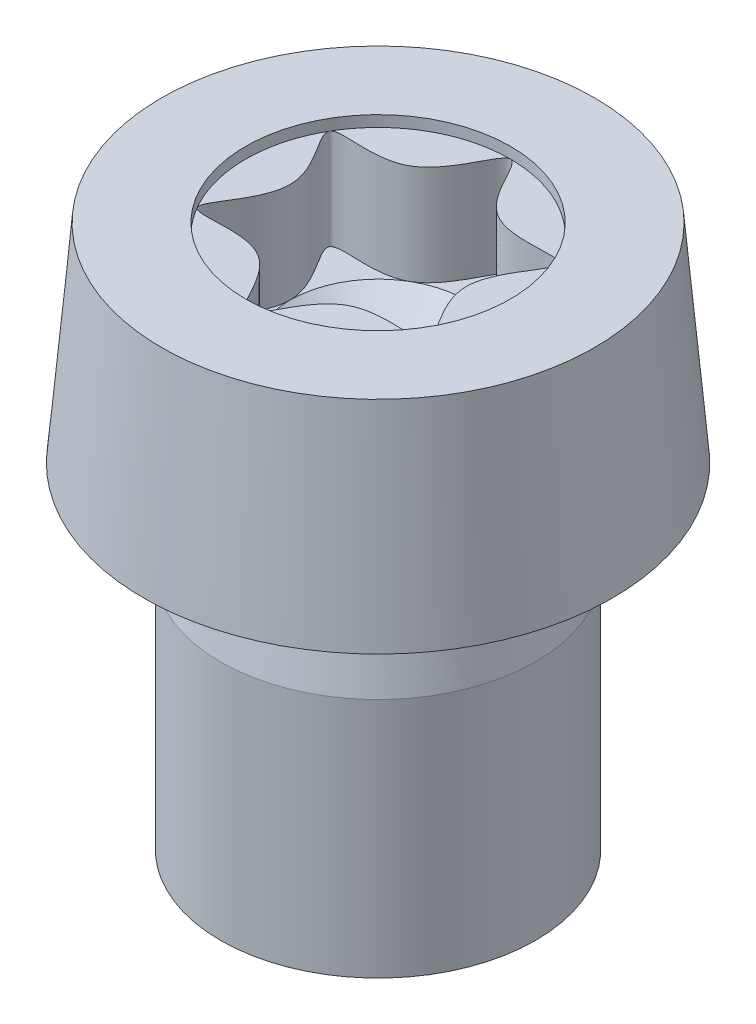
ISO-10303-21;
HEADER;
FILE_DESCRIPTION(('STEP AP214'),'2;1');
FILE_NAME('part.step','',(''),(''),'','','');
FILE_SCHEMA(('AUTOMOTIVE_DESIGN { 1 0 10303 214 1 1 1 1 }'));
ENDSEC;
DATA;
#1=APPLICATION_CONTEXT('core data for automotive mechanical design processes');
#2=APPLICATION_PROTOCOL_DEFINITION('international standard','automotive_design',2000,#1);
#3=PRODUCT_CONTEXT('',#1,'mechanical');
#4=PRODUCT('Part','Part','',(#3));
#5=PRODUCT_RELATED_PRODUCT_CATEGORY('part','',(#4));
#6=PRODUCT_DEFINITION_FORMATION('','',#4);
#7=PRODUCT_DEFINITION_CONTEXT('part definition',#1,'design');
#8=PRODUCT_DEFINITION('design','',#6,#7);
#9=PRODUCT_DEFINITION_SHAPE('','',#8);
#10=(LENGTH_UNIT() NAMED_UNIT(*) SI_UNIT(.MILLI.,.METRE.));
#11=(NAMED_UNIT(*) PLANE_ANGLE_UNIT() SI_UNIT($,.RADIAN.));
#12=(NAMED_UNIT(*) SI_UNIT($,.STERADIAN.) SOLID_ANGLE_UNIT());
#13=UNCERTAINTY_MEASURE_WITH_UNIT(LENGTH_MEASURE(1.E-05),#10,'distance_accuracy_value','');
#14=(GEOMETRIC_REPRESENTATION_CONTEXT(3) GLOBAL_UNCERTAINTY_ASSIGNED_CONTEXT((#13)) GLOBAL_UNIT_ASSIGNED_CONTEXT((#10,
#11,#12)) REPRESENTATION_CONTEXT('',''));
#15=CARTESIAN_POINT('',(0.,0.,0.));
#16=DIRECTION('',(0.,0.,1.));
#17=DIRECTION('',(1.,0.,0.));
#18=AXIS2_PLACEMENT_3D('',#15,#16,#17);
#19=CARTESIAN_POINT('',(0.,6.44,1.975));
#20=DIRECTION('',(0.,1.,0.));
#21=DIRECTION('',(0.,0.,1.));
#22=AXIS2_PLACEMENT_3D('',#19,#20,#21);
#23=PLANE('',#22);
#24=CARTESIAN_POINT('',(0.,6.44,-1.975));
#25=CARTESIAN_POINT('',(0.141989717055241,6.44,-1.975));
#26=CARTESIAN_POINT('',(0.425969151165719,6.44,-0.737800212276023));
#27=CARTESIAN_POINT('',(2.24612339533711,6.44,-1.296799946931));
#28=CARTESIAN_POINT('',(0.851938302331447,6.44,0.));
#29=CARTESIAN_POINT('',(2.24612339533711,6.44,1.29679994693099));
#30=CARTESIAN_POINT('',(0.425969151165727,6.44,0.737800212276034));
#31=CARTESIAN_POINT('',(0.,6.44,2.59359989386198));
#32=CARTESIAN_POINT('',(-0.425969151165738,6.44,0.737800212276044));
#33=CARTESIAN_POINT('',(-2.2461233953371,6.44,1.29679994693099));
#34=CARTESIAN_POINT('',(-0.851938302331447,6.44,0.));
#35=CARTESIAN_POINT('',(-2.2461233953371,6.44,-1.29679994693099));
#36=CARTESIAN_POINT('',(-0.425969151165735,6.44,-0.73780021227603));
#37=CARTESIAN_POINT('',(-0.141989717055244,6.44,-1.975));
#38=CARTESIAN_POINT('',(0.,6.44,-1.975));
#39=B_SPLINE_CURVE_WITH_KNOTS('',3,(#24,#25,#26,#27,#28,#29,#30,#31,#32,#33,#34,#35,#36,#37,
#38),.UNSPECIFIED.,.T.,.F.,(4,1,1,1,1,1,1,1,1,1,1,1,4),(0.,0.0833333333333328,0.166666666666667,
0.25,0.333333333333334,0.416666666666667,0.5,0.583333333333333,0.666666666666667,0.75,
0.833333333333333,0.916666666666666,1.),.UNSPECIFIED.);
#40=CARTESIAN_POINT('',(0.65833333333333,6.44,-1.14026678164951));
#41=VERTEX_POINT('',#40);
#42=CARTESIAN_POINT('',(1.31666666666667,6.44,0.));
#43=VERTEX_POINT('',#42);
#44=EDGE_CURVE('E141',#41,#43,#39,.T.);
#45=ORIENTED_EDGE('',*,*,#44,.F.);
#46=CARTESIAN_POINT('',(0.,6.44,0.));
#47=DIRECTION('',(0.,-1.,0.));
#48=DIRECTION('',(0.,0.,-1.));
#49=AXIS2_PLACEMENT_3D('',#46,#47,#48);
#50=CIRCLE('',#49,1.31666666666667);
#51=EDGE_CURVE('E52',#41,#43,#50,.T.);
#52=ORIENTED_EDGE('',*,*,#51,.T.);
#53=EDGE_LOOP('',(#45,#52));
#54=FACE_BOUND('',#53,.T.);
#55=ADVANCED_FACE('F39',(#54),#23,.T.);
#56=CARTESIAN_POINT('',(0.658333333333332,6.44,1.14026678164951));
#57=VERTEX_POINT('',#56);
#58=EDGE_CURVE('E156',#43,#57,#39,.T.);
#59=ORIENTED_EDGE('',*,*,#58,.F.);
#60=EDGE_CURVE('E11',#43,#57,#50,.T.);
#61=ORIENTED_EDGE('',*,*,#60,.T.);
#62=EDGE_LOOP('',(#59,#61));
#63=FACE_BOUND('',#62,.T.);
#64=ADVANCED_FACE('F109',(#63),#23,.T.);
#65=CARTESIAN_POINT('',(-0.658333333333333,6.44,1.14026678164951));
#66=VERTEX_POINT('',#65);
#67=EDGE_CURVE('E149',#57,#66,#39,.T.);
#68=ORIENTED_EDGE('',*,*,#67,.F.);
#69=EDGE_CURVE('E50',#57,#66,#50,.T.);
#70=ORIENTED_EDGE('',*,*,#69,.T.);
#71=EDGE_LOOP('',(#68,#70));
#72=FACE_BOUND('',#71,.T.);
#73=ADVANCED_FACE('F116',(#72),#23,.T.);
#74=CARTESIAN_POINT('',(-1.31666666666667,6.44,0.));
#75=VERTEX_POINT('',#74);
#76=EDGE_CURVE('E147',#66,#75,#39,.T.);
#77=ORIENTED_EDGE('',*,*,#76,.F.);
#78=EDGE_CURVE('E388',#66,#75,#50,.T.);
#79=ORIENTED_EDGE('',*,*,#78,.T.);
#80=EDGE_LOOP('',(#77,#79));
#81=FACE_BOUND('',#80,.T.);
#82=ADVANCED_FACE('F130',(#81),#23,.T.);
#83=CARTESIAN_POINT('',(-0.658333333333339,6.44,-1.14026678164951));
#84=VERTEX_POINT('',#83);
#85=EDGE_CURVE('E138',#75,#84,#39,.T.);
#86=ORIENTED_EDGE('',*,*,#85,.F.);
#87=EDGE_CURVE('E211',#75,#84,#50,.T.);
#88=ORIENTED_EDGE('',*,*,#87,.T.);
#89=EDGE_LOOP('',(#86,#88));
#90=FACE_BOUND('',#89,.T.);
#91=ADVANCED_FACE('F122',(#90),#23,.T.);
#92=EDGE_CURVE('E134',#84,#41,#39,.T.);
#93=ORIENTED_EDGE('',*,*,#92,.F.);
#94=EDGE_CURVE('E136',#84,#41,#50,.T.);
#95=ORIENTED_EDGE('',*,*,#94,.T.);
#96=EDGE_LOOP('',(#93,#95));
#97=FACE_BOUND('',#96,.T.);
#98=ADVANCED_FACE('F112',(#97),#23,.T.);
#99=CARTESIAN_POINT('',(0.,8.1,0.));
#100=DIRECTION('',(0.,1.,0.));
#101=DIRECTION('',(0.,0.,1.));
#102=AXIS2_PLACEMENT_3D('',#99,#100,#101);
#103=PLANE('',#102);
#104=CARTESIAN_POINT('',(0.,8.1,0.));
#105=DIRECTION('',(0.,1.,0.));
#106=DIRECTION('',(0.,0.,1.));
#107=AXIS2_PLACEMENT_3D('',#104,#105,#106);
#108=CIRCLE('',#107,1.975);
#109=CARTESIAN_POINT('',(0.,8.1,1.975));
#110=VERTEX_POINT('',#109);
#111=EDGE_CURVE('E157',#110,#110,#108,.T.);
#112=ORIENTED_EDGE('',*,*,#111,.F.);
#113=EDGE_LOOP('',(#112));
#114=FACE_BOUND('',#113,.T.);
#115=CARTESIAN_POINT('',(0.,8.1,0.));
#116=DIRECTION('',(0.,-1.,0.));
#117=DIRECTION('',(0.,0.,-1.));
#118=AXIS2_PLACEMENT_3D('',#115,#116,#117);
#119=CIRCLE('',#118,3.22878514306966);
#120=CARTESIAN_POINT('',(0.,8.1,-3.22878514306966));
#121=VERTEX_POINT('',#120);
#122=EDGE_CURVE('E187',#121,#121,#119,.T.);
#123=ORIENTED_EDGE('',*,*,#122,.F.);
#124=EDGE_LOOP('',(#123));
#125=FACE_BOUND('',#124,.T.);
#126=ADVANCED_FACE('F121',(#114,#125),#103,.T.);
#127=CARTESIAN_POINT('',(0.,5.,0.));
#128=DIRECTION('',(0.,-1.,0.));
#129=DIRECTION('',(0.,0.,-1.));
#130=AXIS2_PLACEMENT_3D('',#127,#128,#129);
#131=CONICAL_SURFACE('',#130,3.5,0.0872664625997098);
#132=ORIENTED_EDGE('',*,*,#122,.T.);
#133=EDGE_LOOP('',(#132));
#134=FACE_BOUND('',#133,.T.);
#135=CARTESIAN_POINT('',(0.,5.,0.));
#136=DIRECTION('',(0.,-1.,0.));
#137=DIRECTION('',(0.,0.,-1.));
#138=AXIS2_PLACEMENT_3D('',#135,#136,#137);
#139=CIRCLE('',#138,3.5);
#140=CARTESIAN_POINT('',(0.,5.,-3.5));
#141=VERTEX_POINT('',#140);
#142=EDGE_CURVE('E190',#141,#141,#139,.T.);
#143=ORIENTED_EDGE('',*,*,#142,.F.);
#144=EDGE_LOOP('',(#143));
#145=FACE_BOUND('',#144,.T.);
#146=ADVANCED_FACE('F128',(#134,#145),#131,.T.);
#147=CARTESIAN_POINT('',(2.07,5.,0.));
#148=DIRECTION('',(0.,-1.,0.));
#149=DIRECTION('',(0.,0.,-1.));
#150=AXIS2_PLACEMENT_3D('',#147,#148,#149);
#151=PLANE('',#150);
#152=CARTESIAN_POINT('',(0.,5.,0.));
#153=DIRECTION('',(0.,-1.,0.));
#154=DIRECTION('',(0.,0.,-1.));
#155=AXIS2_PLACEMENT_3D('',#152,#153,#154);
#156=CIRCLE('',#155,2.31396078054371);
#157=CARTESIAN_POINT('',(0.,5.,-2.31396078054371));
#158=VERTEX_POINT('',#157);
#159=EDGE_CURVE('E199',#158,#158,#156,.F.);
#160=ORIENTED_EDGE('',*,*,#159,.T.);
#161=EDGE_LOOP('',(#160));
#162=FACE_BOUND('',#161,.T.);
#163=ORIENTED_EDGE('',*,*,#142,.T.);
#164=EDGE_LOOP('',(#163));
#165=FACE_BOUND('',#164,.T.);
#166=ADVANCED_FACE('F175',(#162,#165),#151,.T.);
#167=CARTESIAN_POINT('',(0.,3.6,0.));
#168=DIRECTION('',(0.,-1.,0.));
#169=DIRECTION('',(0.,0.,-1.));
#170=AXIS2_PLACEMENT_3D('',#167,#168,#169);
#171=CONICAL_SURFACE('',#170,2.35,0.197395559849881);
#172=CARTESIAN_POINT('',(0.,4.76077677297236,0.));
#173=DIRECTION('',(0.,-1.,0.));
#174=DIRECTION('',(0.,0.,-1.));
#175=AXIS2_PLACEMENT_3D('',#172,#173,#174);
#176=CIRCLE('',#175,2.11784464540553);
#177=CARTESIAN_POINT('',(0.,4.76077677297236,-2.11784464540553));
#178=VERTEX_POINT('',#177);
#179=EDGE_CURVE('E194',#178,#178,#176,.T.);
#180=ORIENTED_EDGE('',*,*,#179,.T.);
#181=EDGE_LOOP('',(#180));
#182=FACE_BOUND('',#181,.T.);
#183=CARTESIAN_POINT('',(0.,3.6,0.));
#184=DIRECTION('',(0.,-1.,0.));
#185=DIRECTION('',(0.,0.,-1.));
#186=AXIS2_PLACEMENT_3D('',#183,#184,#185);
#187=CIRCLE('',#186,2.35);
#188=CARTESIAN_POINT('',(0.,3.6,-2.35));
#189=VERTEX_POINT('',#188);
#190=EDGE_CURVE('E192',#189,#189,#187,.T.);
#191=ORIENTED_EDGE('',*,*,#190,.F.);
#192=EDGE_LOOP('',(#191));
#193=FACE_BOUND('',#192,.T.);
#194=ADVANCED_FACE('F171',(#182,#193),#171,.T.);
#195=CARTESIAN_POINT('',(0.,0.,0.));
#196=DIRECTION('',(0.,-1.,0.));
#197=DIRECTION('',(0.,0.,-1.));
#198=AXIS2_PLACEMENT_3D('',#195,#196,#197);
#199=CYLINDRICAL_SURFACE('',#198,2.35);
#200=ORIENTED_EDGE('',*,*,#190,.T.);
#201=EDGE_LOOP('',(#200));
#202=FACE_BOUND('',#201,.T.);
#203=CARTESIAN_POINT('',(0.,0.,0.));
#204=DIRECTION('',(0.,-1.,0.));
#205=DIRECTION('',(0.,0.,-1.));
#206=AXIS2_PLACEMENT_3D('',#203,#204,#205);
#207=CIRCLE('',#206,2.35);
#208=CARTESIAN_POINT('',(0.,0.,-2.35));
#209=VERTEX_POINT('',#208);
#210=EDGE_CURVE('E155',#209,#209,#207,.T.);
#211=ORIENTED_EDGE('',*,*,#210,.F.);
#212=EDGE_LOOP('',(#211));
#213=FACE_BOUND('',#212,.T.);
#214=ADVANCED_FACE('F167',(#202,#213),#199,.T.);
#215=CARTESIAN_POINT('',(2.35,0.,0.));
#216=DIRECTION('',(0.,-1.,0.));
#217=DIRECTION('',(0.,0.,-1.));
#218=AXIS2_PLACEMENT_3D('',#215,#216,#217);
#219=PLANE('',#218);
#220=ORIENTED_EDGE('',*,*,#210,.T.);
#221=EDGE_LOOP('',(#220));
#222=FACE_BOUND('',#221,.T.);
#223=ADVANCED_FACE('F164',(#222),#219,.T.);
#224=CARTESIAN_POINT('',(0.,4.8,0.));
#225=DIRECTION('',(0.,-1.,0.));
#226=DIRECTION('',(0.,0.,-1.));
#227=AXIS2_PLACEMENT_3D('',#224,#225,#226);
#228=TOROIDAL_SURFACE('',#227,2.31396078054371,0.2);
#229=ORIENTED_EDGE('',*,*,#159,.F.);
#230=EDGE_LOOP('',(#229));
#231=FACE_BOUND('',#230,.T.);
#232=ORIENTED_EDGE('',*,*,#179,.F.);
#233=EDGE_LOOP('',(#232));
#234=FACE_BOUND('',#233,.T.);
#235=ADVANCED_FACE('F41',(#231,#234),#228,.F.);
#236=CARTESIAN_POINT('',(0.,7.934,0.));
#237=DIRECTION('',(0.,1.,0.));
#238=DIRECTION('',(0.,0.,1.));
#239=AXIS2_PLACEMENT_3D('',#236,#237,#238);
#240=CYLINDRICAL_SURFACE('',#239,1.975);
#241=ORIENTED_EDGE('',*,*,#111,.T.);
#242=EDGE_LOOP('',(#241));
#243=FACE_BOUND('',#242,.T.);
#244=CARTESIAN_POINT('',(0.,7.934,0.));
#245=DIRECTION('',(0.,1.,0.));
#246=DIRECTION('',(0.,0.,1.));
#247=AXIS2_PLACEMENT_3D('',#244,#245,#246);
#248=CIRCLE('',#247,1.975);
#249=CARTESIAN_POINT('',(1.71040017247427,7.934,0.9875));
#250=VERTEX_POINT('',#249);
#251=CARTESIAN_POINT('',(1.71040017247427,7.934,-0.9875));
#252=VERTEX_POINT('',#251);
#253=EDGE_CURVE('E231',#250,#252,#248,.T.);
#254=ORIENTED_EDGE('',*,*,#253,.F.);
#255=CARTESIAN_POINT('',(0.,7.934,1.975));
#256=VERTEX_POINT('',#255);
#257=EDGE_CURVE('E139',#256,#250,#248,.T.);
#258=ORIENTED_EDGE('',*,*,#257,.F.);
#259=CARTESIAN_POINT('',(-1.71040017247427,7.934,0.987500000000001));
#260=VERTEX_POINT('',#259);
#261=EDGE_CURVE('E222',#260,#256,#248,.T.);
#262=ORIENTED_EDGE('',*,*,#261,.F.);
#263=CARTESIAN_POINT('',(-1.71040017247427,7.934,-0.9875));
#264=VERTEX_POINT('',#263);
#265=EDGE_CURVE('E227',#264,#260,#248,.T.);
#266=ORIENTED_EDGE('',*,*,#265,.F.);
#267=CARTESIAN_POINT('',(0.,7.934,-1.975));
#268=VERTEX_POINT('',#267);
#269=EDGE_CURVE('E265',#268,#264,#248,.T.);
#270=ORIENTED_EDGE('',*,*,#269,.F.);
#271=EDGE_CURVE('E65',#252,#268,#248,.T.);
#272=ORIENTED_EDGE('',*,*,#271,.F.);
#273=EDGE_LOOP('',(#254,#258,#262,#266,#270,#272));
#274=FACE_BOUND('',#273,.T.);
#275=ADVANCED_FACE('F229',(#243,#274),#240,.F.);
#276=CARTESIAN_POINT('',(0.,7.934,0.));
#277=DIRECTION('',(0.,1.,0.));
#278=DIRECTION('',(0.,0.,1.));
#279=AXIS2_PLACEMENT_3D('',#276,#277,#278);
#280=PLANE('',#279);
#281=ORIENTED_EDGE('',*,*,#269,.T.);
#282=CARTESIAN_POINT('',(0.,7.934,-1.975));
#283=CARTESIAN_POINT('',(0.141989717055241,7.934,-1.975));
#284=CARTESIAN_POINT('',(0.425969151165719,7.934,-0.737800212276023));
#285=CARTESIAN_POINT('',(2.24612339533711,7.934,-1.296799946931));
#286=CARTESIAN_POINT('',(0.851938302331447,7.934,0.));
#287=CARTESIAN_POINT('',(2.24612339533711,7.934,1.29679994693099));
#288=CARTESIAN_POINT('',(0.425969151165727,7.934,0.737800212276034));
#289=CARTESIAN_POINT('',(0.,7.934,2.59359989386198));
#290=CARTESIAN_POINT('',(-0.425969151165738,7.934,0.737800212276044));
#291=CARTESIAN_POINT('',(-2.2461233953371,7.934,1.29679994693099));
#292=CARTESIAN_POINT('',(-0.851938302331447,7.934,0.));
#293=CARTESIAN_POINT('',(-2.2461233953371,7.934,-1.29679994693099));
#294=CARTESIAN_POINT('',(-0.425969151165735,7.934,-0.73780021227603));
#295=CARTESIAN_POINT('',(-0.141989717055244,7.934,-1.975));
#296=CARTESIAN_POINT('',(0.,7.934,-1.975));
#297=B_SPLINE_CURVE_WITH_KNOTS('',3,(#282,#283,#284,#285,#286,#287,#288,#289,#290,#291,#292,
#293,#294,#295,#296),.UNSPECIFIED.,.T.,.F.,(4,1,1,1,1,1,1,1,1,1,1,1,4),(0.,0.0833333333333328,
0.166666666666667,0.25,0.333333333333334,0.416666666666667,0.5,0.583333333333333,
0.666666666666667,0.75,0.833333333333333,0.916666666666666,1.),.UNSPECIFIED.);
#298=EDGE_CURVE('E204',#268,#264,#297,.F.);
#299=ORIENTED_EDGE('',*,*,#298,.F.);
#300=EDGE_LOOP('',(#281,#299));
#301=FACE_BOUND('',#300,.T.);
#302=ADVANCED_FACE('F238',(#301),#280,.T.);
#303=ORIENTED_EDGE('',*,*,#265,.T.);
#304=EDGE_CURVE('E208',#264,#260,#297,.F.);
#305=ORIENTED_EDGE('',*,*,#304,.F.);
#306=EDGE_LOOP('',(#303,#305));
#307=FACE_BOUND('',#306,.T.);
#308=ADVANCED_FACE('F243',(#307),#280,.T.);
#309=ORIENTED_EDGE('',*,*,#261,.T.);
#310=EDGE_CURVE('E212',#260,#256,#297,.F.);
#311=ORIENTED_EDGE('',*,*,#310,.F.);
#312=EDGE_LOOP('',(#309,#311));
#313=FACE_BOUND('',#312,.T.);
#314=ADVANCED_FACE('F223',(#313),#280,.T.);
#315=ORIENTED_EDGE('',*,*,#257,.T.);
#316=EDGE_CURVE('E207',#256,#250,#297,.F.);
#317=ORIENTED_EDGE('',*,*,#316,.F.);
#318=EDGE_LOOP('',(#315,#317));
#319=FACE_BOUND('',#318,.T.);
#320=ADVANCED_FACE('F218',(#319),#280,.T.);
#321=ORIENTED_EDGE('',*,*,#253,.T.);
#322=EDGE_CURVE('E203',#250,#252,#297,.F.);
#323=ORIENTED_EDGE('',*,*,#322,.F.);
#324=EDGE_LOOP('',(#321,#323));
#325=FACE_BOUND('',#324,.T.);
#326=ADVANCED_FACE('F247',(#325),#280,.T.);
#327=ORIENTED_EDGE('',*,*,#271,.T.);
#328=EDGE_CURVE('E43',#252,#268,#297,.F.);
#329=ORIENTED_EDGE('',*,*,#328,.F.);
#330=EDGE_LOOP('',(#327,#329));
#331=FACE_BOUND('',#330,.T.);
#332=ADVANCED_FACE('F104',(#331),#280,.T.);
#333=DIRECTION('',(0.,1.,0.));
#334=VECTOR('',#333,1.);
#335=SURFACE_OF_LINEAR_EXTRUSION('',#39,#334);
#336=ORIENTED_EDGE('',*,*,#44,.T.);
#337=ORIENTED_EDGE('',*,*,#58,.T.);
#338=ORIENTED_EDGE('',*,*,#67,.T.);
#339=ORIENTED_EDGE('',*,*,#76,.T.);
#340=ORIENTED_EDGE('',*,*,#85,.T.);
#341=ORIENTED_EDGE('',*,*,#92,.T.);
#342=EDGE_LOOP('',(#336,#337,#338,#339,#340,#341));
#343=FACE_BOUND('',#342,.T.);
#344=ORIENTED_EDGE('',*,*,#328,.T.);
#345=ORIENTED_EDGE('',*,*,#298,.T.);
#346=ORIENTED_EDGE('',*,*,#304,.T.);
#347=ORIENTED_EDGE('',*,*,#310,.T.);
#348=ORIENTED_EDGE('',*,*,#316,.T.);
#349=ORIENTED_EDGE('',*,*,#322,.T.);
#350=EDGE_LOOP('',(#344,#345,#346,#347,#348,#349));
#351=FACE_BOUND('',#350,.T.);
#352=ADVANCED_FACE('F99',(#343,#351),#335,.T.);
#353=CARTESIAN_POINT('',(0.,5.31,0.));
#354=DIRECTION('',(0.,1.,0.));
#355=DIRECTION('',(0.,0.,1.));
#356=AXIS2_PLACEMENT_3D('',#353,#354,#355);
#357=CONICAL_SURFACE('',#356,0.,0.861544924513192);
#358=ORIENTED_EDGE('',*,*,#51,.F.);
#359=ORIENTED_EDGE('',*,*,#94,.F.);
#360=ORIENTED_EDGE('',*,*,#87,.F.);
#361=ORIENTED_EDGE('',*,*,#78,.F.);
#362=ORIENTED_EDGE('',*,*,#69,.F.);
#363=ORIENTED_EDGE('',*,*,#60,.F.);
#364=EDGE_LOOP('',(#358,#359,#360,#361,#362,#363));
#365=FACE_BOUND('',#364,.T.);
#366=CARTESIAN_POINT('',(0.,5.31,0.));
#367=VERTEX_POINT('',#366);
#368=VERTEX_LOOP('',#367);
#369=FACE_BOUND('',#368,.T.);
#370=ADVANCED_FACE('F97',(#365,#369),#357,.F.);
#371=CLOSED_SHELL('',(#55,#64,#73,#82,#91,#98,#126,#146,#166,#194,#214,#223,#235,#275,#302,#308,
#314,#320,#326,#332,#352,#370));
#372=MANIFOLD_SOLID_BREP('B2',#371);
#373=ADVANCED_BREP_SHAPE_REPRESENTATION('',(#18,#372),#14);
#374=SHAPE_DEFINITION_REPRESENTATION(#9,#373);
ENDSEC;
END-ISO-10303-21;
